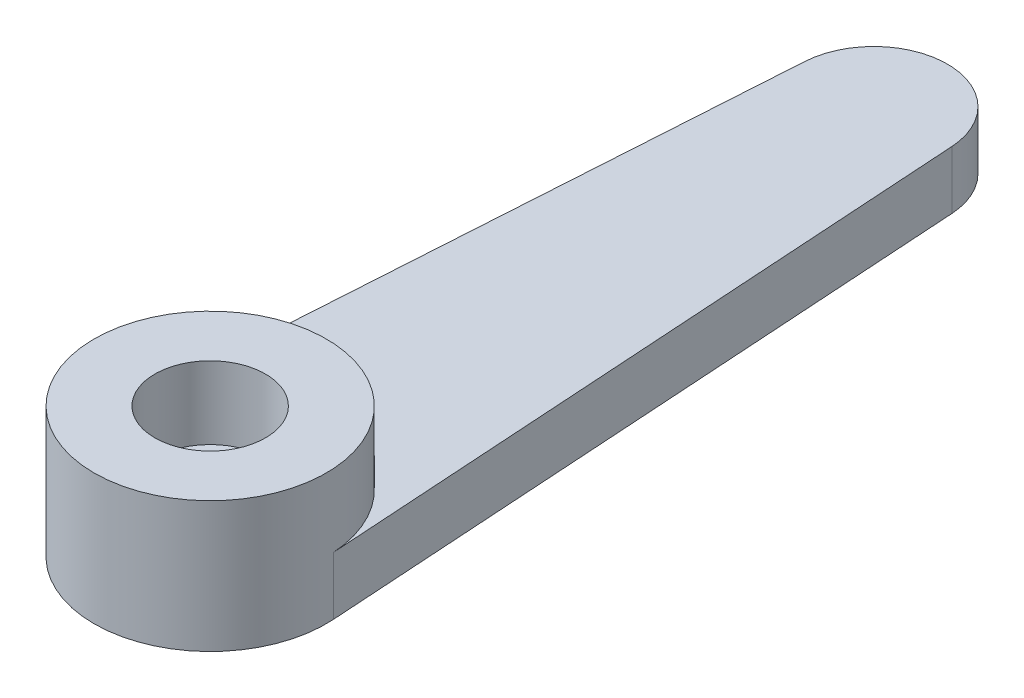
ISO-10303-21;
HEADER;
FILE_DESCRIPTION(('STEP AP214'),'2;1');
FILE_NAME('part.step','',(''),(''),'','','');
FILE_SCHEMA(('AUTOMOTIVE_DESIGN { 1 0 10303 214 1 1 1 1 }'));
ENDSEC;
DATA;
#1=APPLICATION_CONTEXT('core data for automotive mechanical design processes');
#2=APPLICATION_PROTOCOL_DEFINITION('international standard','automotive_design',2000,#1);
#3=PRODUCT_CONTEXT('',#1,'mechanical');
#4=PRODUCT('Part','Part','',(#3));
#5=PRODUCT_RELATED_PRODUCT_CATEGORY('part','',(#4));
#6=PRODUCT_DEFINITION_FORMATION('','',#4);
#7=PRODUCT_DEFINITION_CONTEXT('part definition',#1,'design');
#8=PRODUCT_DEFINITION('design','',#6,#7);
#9=PRODUCT_DEFINITION_SHAPE('','',#8);
#10=(LENGTH_UNIT() NAMED_UNIT(*) SI_UNIT(.MILLI.,.METRE.));
#11=(NAMED_UNIT(*) PLANE_ANGLE_UNIT() SI_UNIT($,.RADIAN.));
#12=(NAMED_UNIT(*) SI_UNIT($,.STERADIAN.) SOLID_ANGLE_UNIT());
#13=UNCERTAINTY_MEASURE_WITH_UNIT(LENGTH_MEASURE(1.E-05),#10,'distance_accuracy_value','');
#14=(GEOMETRIC_REPRESENTATION_CONTEXT(3) GLOBAL_UNCERTAINTY_ASSIGNED_CONTEXT((#13)) GLOBAL_UNIT_ASSIGNED_CONTEXT((#10,
#11,#12)) REPRESENTATION_CONTEXT('',''));
#15=CARTESIAN_POINT('',(0.,0.,0.));
#16=DIRECTION('',(0.,0.,1.));
#17=DIRECTION('',(1.,0.,0.));
#18=AXIS2_PLACEMENT_3D('',#15,#16,#17);
#19=CARTESIAN_POINT('',(3.99183367226178,2.,-0.255468066491688));
#20=DIRECTION('',(0.997958418065446,0.,-0.0638670166229221));
#21=DIRECTION('',(-0.0638670166229221,0.,-0.997958418065446));
#22=AXIS2_PLACEMENT_3D('',#19,#20,#21);
#23=PLANE('',#22);
#24=DIRECTION('',(0.0638670166229221,0.,0.997958418065446));
#25=VECTOR('',#24,1.);
#26=CARTESIAN_POINT('',(3.99183367226178,0.,-0.255468066491688));
#27=LINE('',#26,#25);
#28=CARTESIAN_POINT('',(2.53481438188623,0.,-23.0222222222222));
#29=VERTEX_POINT('',#28);
#30=CARTESIAN_POINT('',(3.99183367226178,0.,-0.255468066491689));
#31=VERTEX_POINT('',#30);
#32=EDGE_CURVE('E101',#29,#31,#27,.T.);
#33=ORIENTED_EDGE('',*,*,#32,.F.);
#34=DIRECTION('',(0.,-1.,0.));
#35=VECTOR('',#34,1.);
#36=CARTESIAN_POINT('',(2.53481438188623,2.,-23.0222222222222));
#37=LINE('',#36,#35);
#38=CARTESIAN_POINT('',(2.53481438188623,2.,-23.0222222222222));
#39=VERTEX_POINT('',#38);
#40=EDGE_CURVE('E11',#39,#29,#37,.T.);
#41=ORIENTED_EDGE('',*,*,#40,.F.);
#42=DIRECTION('',(0.0638670166229221,0.,0.997958418065446));
#43=VECTOR('',#42,1.);
#44=CARTESIAN_POINT('',(3.99183367226178,2.,-0.255468066491688));
#45=LINE('',#44,#43);
#46=CARTESIAN_POINT('',(3.99183367226178,2.,-0.255468066491688));
#47=VERTEX_POINT('',#46);
#48=EDGE_CURVE('E83',#39,#47,#45,.T.);
#49=ORIENTED_EDGE('',*,*,#48,.T.);
#50=DIRECTION('',(0.,-1.,0.));
#51=VECTOR('',#50,1.);
#52=CARTESIAN_POINT('',(3.99183367226178,2.,-0.255468066491689));
#53=LINE('',#52,#51);
#54=EDGE_CURVE('E77',#47,#31,#53,.T.);
#55=ORIENTED_EDGE('',*,*,#54,.T.);
#56=EDGE_LOOP('',(#33,#41,#49,#55));
#57=FACE_BOUND('',#56,.T.);
#58=ADVANCED_FACE('F38',(#57),#23,.T.);
#59=CARTESIAN_POINT('',(0.,2.,-22.86));
#60=DIRECTION('',(0.,-1.,0.));
#61=DIRECTION('',(0.,0.,-1.));
#62=AXIS2_PLACEMENT_3D('',#59,#60,#61);
#63=CYLINDRICAL_SURFACE('',#62,2.54);
#64=CARTESIAN_POINT('',(0.,0.,-22.86));
#65=DIRECTION('',(0.,1.,0.));
#66=DIRECTION('',(0.,0.,1.));
#67=AXIS2_PLACEMENT_3D('',#64,#65,#66);
#68=CIRCLE('',#67,2.54);
#69=CARTESIAN_POINT('',(-2.53481438188623,0.,-23.0222222222222));
#70=VERTEX_POINT('',#69);
#71=EDGE_CURVE('E111',#29,#70,#68,.T.);
#72=ORIENTED_EDGE('',*,*,#71,.T.);
#73=DIRECTION('',(0.,-1.,0.));
#74=VECTOR('',#73,1.);
#75=CARTESIAN_POINT('',(-2.53481438188623,2.,-23.0222222222222));
#76=LINE('',#75,#74);
#77=CARTESIAN_POINT('',(-2.53481438188623,2.,-23.0222222222222));
#78=VERTEX_POINT('',#77);
#79=EDGE_CURVE('E46',#78,#70,#76,.T.);
#80=ORIENTED_EDGE('',*,*,#79,.F.);
#81=CARTESIAN_POINT('',(0.,2.,-22.86));
#82=DIRECTION('',(0.,1.,0.));
#83=DIRECTION('',(0.,0.,1.));
#84=AXIS2_PLACEMENT_3D('',#81,#82,#83);
#85=CIRCLE('',#84,2.54);
#86=EDGE_CURVE('E84',#39,#78,#85,.T.);
#87=ORIENTED_EDGE('',*,*,#86,.F.);
#88=ORIENTED_EDGE('',*,*,#40,.T.);
#89=EDGE_LOOP('',(#72,#80,#87,#88));
#90=FACE_BOUND('',#89,.T.);
#91=ADVANCED_FACE('F121',(#90),#63,.T.);
#92=CARTESIAN_POINT('',(-3.99183367226178,2.,-0.255468066491689));
#93=DIRECTION('',(0.997958418065446,0.,0.0638670166229221));
#94=DIRECTION('',(0.0638670166229221,0.,-0.997958418065446));
#95=AXIS2_PLACEMENT_3D('',#92,#93,#94);
#96=PLANE('',#95);
#97=DIRECTION('',(-0.0638670166229221,0.,0.997958418065446));
#98=VECTOR('',#97,1.);
#99=CARTESIAN_POINT('',(-3.99183367226178,0.,-0.255468066491689));
#100=LINE('',#99,#98);
#101=CARTESIAN_POINT('',(-3.99183367226178,0.,-0.255468066491689));
#102=VERTEX_POINT('',#101);
#103=EDGE_CURVE('E70',#70,#102,#100,.T.);
#104=ORIENTED_EDGE('',*,*,#103,.T.);
#105=DIRECTION('',(0.,-1.,0.));
#106=VECTOR('',#105,1.);
#107=CARTESIAN_POINT('',(-3.99183367226178,2.,-0.255468066491689));
#108=LINE('',#107,#106);
#109=CARTESIAN_POINT('',(-3.99183367226178,2.,-0.255468066491689));
#110=VERTEX_POINT('',#109);
#111=EDGE_CURVE('E94',#110,#102,#108,.T.);
#112=ORIENTED_EDGE('',*,*,#111,.F.);
#113=DIRECTION('',(-0.0638670166229221,0.,0.997958418065446));
#114=VECTOR('',#113,1.);
#115=CARTESIAN_POINT('',(-3.99183367226178,2.,-0.255468066491689));
#116=LINE('',#115,#114);
#117=EDGE_CURVE('E54',#78,#110,#116,.T.);
#118=ORIENTED_EDGE('',*,*,#117,.F.);
#119=ORIENTED_EDGE('',*,*,#79,.T.);
#120=EDGE_LOOP('',(#104,#112,#118,#119));
#121=FACE_BOUND('',#120,.T.);
#122=ADVANCED_FACE('F116',(#121),#96,.F.);
#123=CARTESIAN_POINT('',(0.,2.,0.));
#124=DIRECTION('',(0.,-1.,0.));
#125=DIRECTION('',(0.,0.,-1.));
#126=AXIS2_PLACEMENT_3D('',#123,#124,#125);
#127=CYLINDRICAL_SURFACE('',#126,4.);
#128=CARTESIAN_POINT('',(0.,0.,0.));
#129=DIRECTION('',(0.,1.,0.));
#130=DIRECTION('',(0.,0.,1.));
#131=AXIS2_PLACEMENT_3D('',#128,#129,#130);
#132=CIRCLE('',#131,4.);
#133=EDGE_CURVE('E85',#102,#31,#132,.T.);
#134=ORIENTED_EDGE('',*,*,#133,.T.);
#135=ORIENTED_EDGE('',*,*,#54,.F.);
#136=CARTESIAN_POINT('',(0.,2.,0.));
#137=DIRECTION('',(0.,1.,0.));
#138=DIRECTION('',(0.,0.,1.));
#139=AXIS2_PLACEMENT_3D('',#136,#137,#138);
#140=CIRCLE('',#139,4.);
#141=EDGE_CURVE('E91',#47,#110,#140,.T.);
#142=ORIENTED_EDGE('',*,*,#141,.T.);
#143=ORIENTED_EDGE('',*,*,#111,.T.);
#144=EDGE_LOOP('',(#134,#135,#142,#143));
#145=FACE_BOUND('',#144,.T.);
#146=CARTESIAN_POINT('',(0.,4.5,0.));
#147=DIRECTION('',(0.,1.,0.));
#148=DIRECTION('',(0.,0.,1.));
#149=AXIS2_PLACEMENT_3D('',#146,#147,#148);
#150=CIRCLE('',#149,4.);
#151=CARTESIAN_POINT('',(0.,4.5,4.));
#152=VERTEX_POINT('',#151);
#153=EDGE_CURVE('E97',#152,#152,#150,.T.);
#154=ORIENTED_EDGE('',*,*,#153,.F.);
#155=EDGE_LOOP('',(#154));
#156=FACE_BOUND('',#155,.T.);
#157=ADVANCED_FACE('F89',(#145,#156),#127,.T.);
#158=CARTESIAN_POINT('',(0.,2.,0.));
#159=DIRECTION('',(0.,1.,0.));
#160=DIRECTION('',(0.,0.,1.));
#161=AXIS2_PLACEMENT_3D('',#158,#159,#160);
#162=PLANE('',#161);
#163=ORIENTED_EDGE('',*,*,#141,.F.);
#164=ORIENTED_EDGE('',*,*,#48,.F.);
#165=ORIENTED_EDGE('',*,*,#86,.T.);
#166=ORIENTED_EDGE('',*,*,#117,.T.);
#167=EDGE_LOOP('',(#163,#164,#165,#166));
#168=FACE_BOUND('',#167,.T.);
#169=ADVANCED_FACE('F96',(#168),#162,.T.);
#170=CARTESIAN_POINT('',(0.,0.,0.));
#171=DIRECTION('',(0.,1.,0.));
#172=DIRECTION('',(0.,0.,1.));
#173=AXIS2_PLACEMENT_3D('',#170,#171,#172);
#174=PLANE('',#173);
#175=ORIENTED_EDGE('',*,*,#32,.T.);
#176=ORIENTED_EDGE('',*,*,#133,.F.);
#177=ORIENTED_EDGE('',*,*,#103,.F.);
#178=ORIENTED_EDGE('',*,*,#71,.F.);
#179=EDGE_LOOP('',(#175,#176,#177,#178));
#180=FACE_BOUND('',#179,.T.);
#181=ADVANCED_FACE('F120',(#180),#174,.F.);
#182=CARTESIAN_POINT('',(0.,4.5,0.));
#183=DIRECTION('',(0.,1.,0.));
#184=DIRECTION('',(0.,0.,1.));
#185=AXIS2_PLACEMENT_3D('',#182,#183,#184);
#186=PLANE('',#185);
#187=ORIENTED_EDGE('',*,*,#153,.T.);
#188=EDGE_LOOP('',(#187));
#189=FACE_BOUND('',#188,.T.);
#190=CARTESIAN_POINT('',(0.,4.5,0.));
#191=DIRECTION('',(0.,1.,0.));
#192=DIRECTION('',(0.,0.,1.));
#193=AXIS2_PLACEMENT_3D('',#190,#191,#192);
#194=CIRCLE('',#193,1.90638532611638);
#195=CARTESIAN_POINT('',(0.,4.5,1.90638532611638));
#196=VERTEX_POINT('',#195);
#197=EDGE_CURVE('E98',#196,#196,#194,.T.);
#198=ORIENTED_EDGE('',*,*,#197,.F.);
#199=EDGE_LOOP('',(#198));
#200=FACE_BOUND('',#199,.T.);
#201=ADVANCED_FACE('F133',(#189,#200),#186,.T.);
#202=CARTESIAN_POINT('',(0.,4.5,0.));
#203=DIRECTION('',(0.,-1.,0.));
#204=DIRECTION('',(0.,0.,-1.));
#205=AXIS2_PLACEMENT_3D('',#202,#203,#204);
#206=CYLINDRICAL_SURFACE('',#205,1.90638532611638);
#207=ORIENTED_EDGE('',*,*,#197,.T.);
#208=EDGE_LOOP('',(#207));
#209=FACE_BOUND('',#208,.T.);
#210=CARTESIAN_POINT('',(0.,2.,0.));
#211=DIRECTION('',(0.,1.,0.));
#212=DIRECTION('',(0.,0.,1.));
#213=AXIS2_PLACEMENT_3D('',#210,#211,#212);
#214=CIRCLE('',#213,1.90638532611638);
#215=CARTESIAN_POINT('',(0.,2.,1.90638532611638));
#216=VERTEX_POINT('',#215);
#217=EDGE_CURVE('E104',#216,#216,#214,.T.);
#218=ORIENTED_EDGE('',*,*,#217,.F.);
#219=EDGE_LOOP('',(#218));
#220=FACE_BOUND('',#219,.T.);
#221=ADVANCED_FACE('F139',(#209,#220),#206,.F.);
#222=ORIENTED_EDGE('',*,*,#217,.T.);
#223=EDGE_LOOP('',(#222));
#224=FACE_BOUND('',#223,.T.);
#225=ADVANCED_FACE('F136',(#224),#162,.T.);
#226=CLOSED_SHELL('',(#58,#91,#122,#157,#169,#181,#201,#221,#225));
#227=MANIFOLD_SOLID_BREP('B2',#226);
#228=ADVANCED_BREP_SHAPE_REPRESENTATION('',(#18,#227),#14);
#229=SHAPE_DEFINITION_REPRESENTATION(#9,#228);
ENDSEC;
END-ISO-10303-21;
